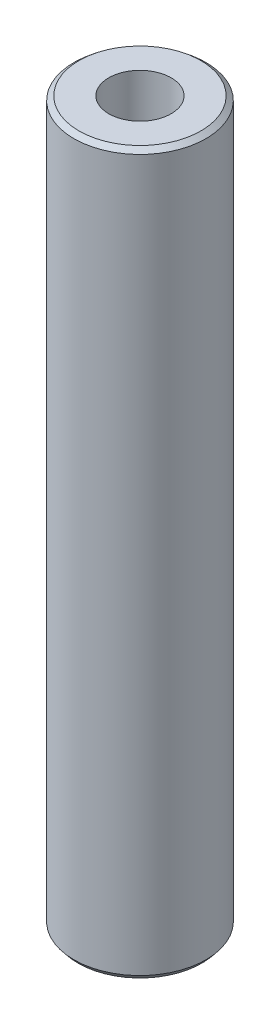
ISO-10303-21;
HEADER;
FILE_DESCRIPTION(('STEP AP214'),'2;1');
FILE_NAME('part.step','',(''),(''),'','','');
FILE_SCHEMA(('AUTOMOTIVE_DESIGN { 1 0 10303 214 1 1 1 1 }'));
ENDSEC;
DATA;
#1=APPLICATION_CONTEXT('core data for automotive mechanical design processes');
#2=APPLICATION_PROTOCOL_DEFINITION('international standard','automotive_design',2000,#1);
#3=PRODUCT_CONTEXT('',#1,'mechanical');
#4=PRODUCT('Part','Part','',(#3));
#5=PRODUCT_RELATED_PRODUCT_CATEGORY('part','',(#4));
#6=PRODUCT_DEFINITION_FORMATION('','',#4);
#7=PRODUCT_DEFINITION_CONTEXT('part definition',#1,'design');
#8=PRODUCT_DEFINITION('design','',#6,#7);
#9=PRODUCT_DEFINITION_SHAPE('','',#8);
#10=(LENGTH_UNIT() NAMED_UNIT(*) SI_UNIT(.MILLI.,.METRE.));
#11=(NAMED_UNIT(*) PLANE_ANGLE_UNIT() SI_UNIT($,.RADIAN.));
#12=(NAMED_UNIT(*) SI_UNIT($,.STERADIAN.) SOLID_ANGLE_UNIT());
#13=UNCERTAINTY_MEASURE_WITH_UNIT(LENGTH_MEASURE(1.E-05),#10,'distance_accuracy_value','');
#14=(GEOMETRIC_REPRESENTATION_CONTEXT(3) GLOBAL_UNCERTAINTY_ASSIGNED_CONTEXT((#13)) GLOBAL_UNIT_ASSIGNED_CONTEXT((#10,
#11,#12)) REPRESENTATION_CONTEXT('',''));
#15=CARTESIAN_POINT('',(0.,0.,0.));
#16=DIRECTION('',(0.,0.,1.));
#17=DIRECTION('',(1.,0.,0.));
#18=AXIS2_PLACEMENT_3D('',#15,#16,#17);
#19=CARTESIAN_POINT('',(0.,600.,0.));
#20=DIRECTION('',(0.,-1.,0.));
#21=DIRECTION('',(0.,0.,-1.));
#22=AXIS2_PLACEMENT_3D('',#19,#20,#21);
#23=CYLINDRICAL_SURFACE('',#22,55.);
#24=CARTESIAN_POINT('',(0.,596.540531603823,0.));
#25=DIRECTION('',(0.,1.,0.));
#26=DIRECTION('',(0.,0.,1.));
#27=AXIS2_PLACEMENT_3D('',#24,#25,#26);
#28=CIRCLE('',#27,55.);
#29=CARTESIAN_POINT('',(0.,596.540531603823,55.));
#30=VERTEX_POINT('',#29);
#31=EDGE_CURVE('E50',#30,#30,#28,.F.);
#32=ORIENTED_EDGE('',*,*,#31,.T.);
#33=EDGE_LOOP('',(#32));
#34=FACE_BOUND('',#33,.T.);
#35=CARTESIAN_POINT('',(0.,4.22445514688952,0.));
#36=DIRECTION('',(0.,1.,0.));
#37=DIRECTION('',(0.,0.,1.));
#38=AXIS2_PLACEMENT_3D('',#35,#36,#37);
#39=CIRCLE('',#38,55.);
#40=CARTESIAN_POINT('',(0.,4.22445514688952,55.));
#41=VERTEX_POINT('',#40);
#42=EDGE_CURVE('E51',#41,#41,#39,.T.);
#43=ORIENTED_EDGE('',*,*,#42,.T.);
#44=EDGE_LOOP('',(#43));
#45=FACE_BOUND('',#44,.T.);
#46=ADVANCED_FACE('F39',(#34,#45),#23,.T.);
#47=CARTESIAN_POINT('',(0.,600.,0.));
#48=DIRECTION('',(0.,1.,0.));
#49=DIRECTION('',(0.,0.,1.));
#50=AXIS2_PLACEMENT_3D('',#47,#48,#49);
#51=PLANE('',#50);
#52=CARTESIAN_POINT('',(0.,600.,0.));
#53=DIRECTION('',(0.,1.,0.));
#54=DIRECTION('',(0.,0.,1.));
#55=AXIS2_PLACEMENT_3D('',#52,#53,#54);
#56=CIRCLE('',#55,50.7755448531105);
#57=CARTESIAN_POINT('',(0.,600.,50.7755448531105));
#58=VERTEX_POINT('',#57);
#59=EDGE_CURVE('E54',#58,#58,#56,.T.);
#60=ORIENTED_EDGE('',*,*,#59,.T.);
#61=EDGE_LOOP('',(#60));
#62=FACE_BOUND('',#61,.T.);
#63=CARTESIAN_POINT('',(0.,600.,0.));
#64=DIRECTION('',(0.,1.,0.));
#65=DIRECTION('',(0.,0.,1.));
#66=AXIS2_PLACEMENT_3D('',#63,#64,#65);
#67=CIRCLE('',#66,25.9896119053635);
#68=CARTESIAN_POINT('',(0.,600.,25.9896119053635));
#69=VERTEX_POINT('',#68);
#70=EDGE_CURVE('E58',#69,#69,#67,.T.);
#71=ORIENTED_EDGE('',*,*,#70,.F.);
#72=EDGE_LOOP('',(#71));
#73=FACE_BOUND('',#72,.T.);
#74=ADVANCED_FACE('F69',(#62,#73),#51,.T.);
#75=CARTESIAN_POINT('',(0.,0.,0.));
#76=DIRECTION('',(0.,1.,0.));
#77=DIRECTION('',(0.,0.,1.));
#78=AXIS2_PLACEMENT_3D('',#75,#76,#77);
#79=PLANE('',#78);
#80=CARTESIAN_POINT('',(0.,0.,0.));
#81=DIRECTION('',(0.,1.,0.));
#82=DIRECTION('',(0.,0.,1.));
#83=AXIS2_PLACEMENT_3D('',#80,#81,#82);
#84=CIRCLE('',#83,51.5405316038231);
#85=CARTESIAN_POINT('',(0.,0.,51.5405316038231));
#86=VERTEX_POINT('',#85);
#87=EDGE_CURVE('E10',#86,#86,#84,.F.);
#88=ORIENTED_EDGE('',*,*,#87,.T.);
#89=EDGE_LOOP('',(#88));
#90=FACE_BOUND('',#89,.T.);
#91=CARTESIAN_POINT('',(0.,0.,0.));
#92=DIRECTION('',(0.,1.,0.));
#93=DIRECTION('',(0.,0.,1.));
#94=AXIS2_PLACEMENT_3D('',#91,#92,#93);
#95=CIRCLE('',#94,25.9896119053635);
#96=CARTESIAN_POINT('',(0.,0.,25.9896119053635));
#97=VERTEX_POINT('',#96);
#98=EDGE_CURVE('E63',#97,#97,#95,.T.);
#99=ORIENTED_EDGE('',*,*,#98,.T.);
#100=EDGE_LOOP('',(#99));
#101=FACE_BOUND('',#100,.T.);
#102=ADVANCED_FACE('F75',(#90,#101),#79,.F.);
#103=CARTESIAN_POINT('',(0.,600.,0.));
#104=DIRECTION('',(0.,-1.,0.));
#105=DIRECTION('',(0.,0.,-1.));
#106=AXIS2_PLACEMENT_3D('',#103,#104,#105);
#107=CYLINDRICAL_SURFACE('',#106,25.9896119053635);
#108=ORIENTED_EDGE('',*,*,#70,.T.);
#109=EDGE_LOOP('',(#108));
#110=FACE_BOUND('',#109,.T.);
#111=ORIENTED_EDGE('',*,*,#98,.F.);
#112=EDGE_LOOP('',(#111));
#113=FACE_BOUND('',#112,.T.);
#114=ADVANCED_FACE('F70',(#110,#113),#107,.F.);
#115=CARTESIAN_POINT('',(0.,600.,0.));
#116=DIRECTION('',(0.,-1.,0.));
#117=DIRECTION('',(0.,0.,-1.));
#118=AXIS2_PLACEMENT_3D('',#115,#116,#117);
#119=CONICAL_SURFACE('',#118,50.7755448531105,0.884627973351491);
#120=ORIENTED_EDGE('',*,*,#31,.F.);
#121=EDGE_LOOP('',(#120));
#122=FACE_BOUND('',#121,.T.);
#123=ORIENTED_EDGE('',*,*,#59,.F.);
#124=EDGE_LOOP('',(#123));
#125=FACE_BOUND('',#124,.T.);
#126=ADVANCED_FACE('F81',(#122,#125),#119,.T.);
#127=CARTESIAN_POINT('',(0.,4.22445514688952,0.));
#128=DIRECTION('',(0.,1.,0.));
#129=DIRECTION('',(0.,0.,1.));
#130=AXIS2_PLACEMENT_3D('',#127,#128,#129);
#131=CONICAL_SURFACE('',#130,55.,0.686168353443416);
#132=ORIENTED_EDGE('',*,*,#87,.F.);
#133=EDGE_LOOP('',(#132));
#134=FACE_BOUND('',#133,.T.);
#135=ORIENTED_EDGE('',*,*,#42,.F.);
#136=EDGE_LOOP('',(#135));
#137=FACE_BOUND('',#136,.T.);
#138=ADVANCED_FACE('F45',(#134,#137),#131,.T.);
#139=CLOSED_SHELL('',(#46,#74,#102,#114,#126,#138));
#140=MANIFOLD_SOLID_BREP('B2',#139);
#141=ADVANCED_BREP_SHAPE_REPRESENTATION('',(#18,#140),#14);
#142=SHAPE_DEFINITION_REPRESENTATION(#9,#141);
ENDSEC;
END-ISO-10303-21;
